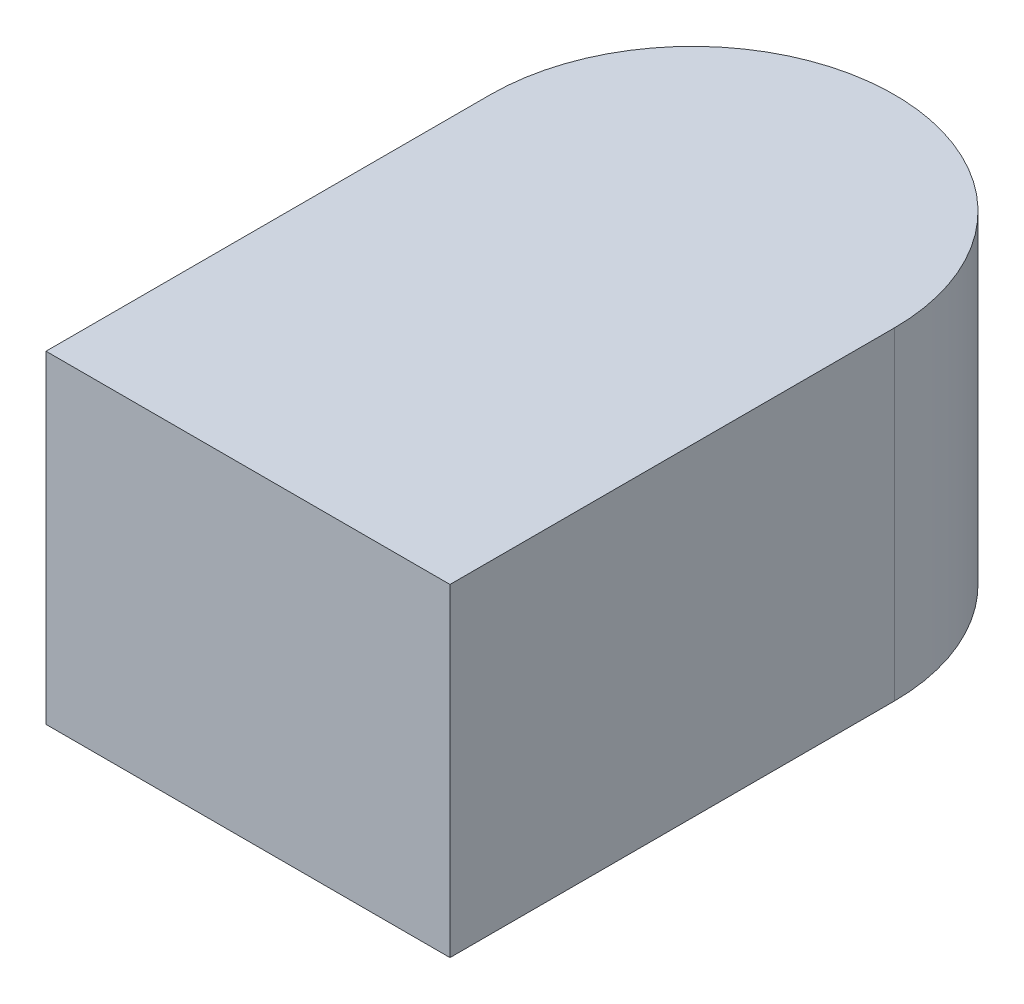
ISO-10303-21;
HEADER;
FILE_DESCRIPTION(('STEP AP214'),'2;1');
FILE_NAME('part.step','',(''),(''),'','','');
FILE_SCHEMA(('AUTOMOTIVE_DESIGN { 1 0 10303 214 1 1 1 1 }'));
ENDSEC;
DATA;
#1=APPLICATION_CONTEXT('core data for automotive mechanical design processes');
#2=APPLICATION_PROTOCOL_DEFINITION('international standard','automotive_design',2000,#1);
#3=PRODUCT_CONTEXT('',#1,'mechanical');
#4=PRODUCT('Part','Part','',(#3));
#5=PRODUCT_RELATED_PRODUCT_CATEGORY('part','',(#4));
#6=PRODUCT_DEFINITION_FORMATION('','',#4);
#7=PRODUCT_DEFINITION_CONTEXT('part definition',#1,'design');
#8=PRODUCT_DEFINITION('design','',#6,#7);
#9=PRODUCT_DEFINITION_SHAPE('','',#8);
#10=(LENGTH_UNIT() NAMED_UNIT(*) SI_UNIT(.MILLI.,.METRE.));
#11=(NAMED_UNIT(*) PLANE_ANGLE_UNIT() SI_UNIT($,.RADIAN.));
#12=(NAMED_UNIT(*) SI_UNIT($,.STERADIAN.) SOLID_ANGLE_UNIT());
#13=UNCERTAINTY_MEASURE_WITH_UNIT(LENGTH_MEASURE(1.E-05),#10,'distance_accuracy_value','');
#14=(GEOMETRIC_REPRESENTATION_CONTEXT(3) GLOBAL_UNCERTAINTY_ASSIGNED_CONTEXT((#13)) GLOBAL_UNIT_ASSIGNED_CONTEXT((#10,
#11,#12)) REPRESENTATION_CONTEXT('',''));
#15=CARTESIAN_POINT('',(0.,0.,0.));
#16=DIRECTION('',(0.,0.,1.));
#17=DIRECTION('',(1.,0.,0.));
#18=AXIS2_PLACEMENT_3D('',#15,#16,#17);
#19=CARTESIAN_POINT('',(0.,0.,0.));
#20=DIRECTION('',(0.,-1.,0.));
#21=DIRECTION('',(1.,0.,0.));
#22=AXIS2_PLACEMENT_3D('',#19,#20,#21);
#23=PLANE('',#22);
#24=CARTESIAN_POINT('',(-0.25,0.,1.225));
#25=DIRECTION('',(0.,-1.,0.));
#26=DIRECTION('',(-1.,0.,0.));
#27=AXIS2_PLACEMENT_3D('',#24,#25,#26);
#28=CIRCLE('',#27,0.125);
#29=CARTESIAN_POINT('',(-0.375,0.,1.225));
#30=VERTEX_POINT('',#29);
#31=CARTESIAN_POINT('',(-0.125,0.,1.225));
#32=VERTEX_POINT('',#31);
#33=EDGE_CURVE('E11',#30,#32,#28,.T.);
#34=ORIENTED_EDGE('',*,*,#33,.T.);
#35=DIRECTION('',(0.,0.,1.));
#36=VECTOR('',#35,1.);
#37=CARTESIAN_POINT('',(-0.125,0.,1.225));
#38=LINE('',#37,#36);
#39=CARTESIAN_POINT('',(-0.125,0.,1.5));
#40=VERTEX_POINT('',#39);
#41=EDGE_CURVE('E24',#32,#40,#38,.T.);
#42=ORIENTED_EDGE('',*,*,#41,.T.);
#43=DIRECTION('',(-1.,0.,0.));
#44=VECTOR('',#43,1.);
#45=CARTESIAN_POINT('',(-0.125,0.,1.5));
#46=LINE('',#45,#44);
#47=CARTESIAN_POINT('',(-0.375,0.,1.5));
#48=VERTEX_POINT('',#47);
#49=EDGE_CURVE('E62',#40,#48,#46,.T.);
#50=ORIENTED_EDGE('',*,*,#49,.T.);
#51=DIRECTION('',(0.,0.,-1.));
#52=VECTOR('',#51,1.);
#53=CARTESIAN_POINT('',(-0.375,0.,1.5));
#54=LINE('',#53,#52);
#55=EDGE_CURVE('E36',#48,#30,#54,.T.);
#56=ORIENTED_EDGE('',*,*,#55,.T.);
#57=EDGE_LOOP('',(#34,#42,#50,#56));
#58=FACE_BOUND('',#57,.T.);
#59=ADVANCED_FACE('F17',(#58),#23,.T.);
#60=CARTESIAN_POINT('',(-0.375,0.,1.5));
#61=DIRECTION('',(1.,0.,0.));
#62=DIRECTION('',(0.,0.,-1.));
#63=AXIS2_PLACEMENT_3D('',#60,#61,#62);
#64=PLANE('',#63);
#65=DIRECTION('',(0.,1.,0.));
#66=VECTOR('',#65,1.);
#67=CARTESIAN_POINT('',(-0.375,0.,1.5));
#68=LINE('',#67,#66);
#69=CARTESIAN_POINT('',(-0.375,0.2,1.5));
#70=VERTEX_POINT('',#69);
#71=EDGE_CURVE('E84',#48,#70,#68,.T.);
#72=ORIENTED_EDGE('',*,*,#71,.T.);
#73=DIRECTION('',(0.,0.,-1.));
#74=VECTOR('',#73,1.);
#75=CARTESIAN_POINT('',(-0.375,0.2,1.5));
#76=LINE('',#75,#74);
#77=CARTESIAN_POINT('',(-0.375,0.2,1.225));
#78=VERTEX_POINT('',#77);
#79=EDGE_CURVE('E74',#70,#78,#76,.T.);
#80=ORIENTED_EDGE('',*,*,#79,.T.);
#81=DIRECTION('',(0.,1.,0.));
#82=VECTOR('',#81,1.);
#83=CARTESIAN_POINT('',(-0.375,0.,1.225));
#84=LINE('',#83,#82);
#85=EDGE_CURVE('E81',#30,#78,#84,.T.);
#86=ORIENTED_EDGE('',*,*,#85,.F.);
#87=ORIENTED_EDGE('',*,*,#55,.F.);
#88=EDGE_LOOP('',(#72,#80,#86,#87));
#89=FACE_BOUND('',#88,.T.);
#90=ADVANCED_FACE('F91',(#89),#64,.F.);
#91=CARTESIAN_POINT('',(-0.25,0.,1.225));
#92=DIRECTION('',(0.,-1.,0.));
#93=DIRECTION('',(1.,0.,0.));
#94=AXIS2_PLACEMENT_3D('',#91,#92,#93);
#95=CYLINDRICAL_SURFACE('',#94,0.125);
#96=ORIENTED_EDGE('',*,*,#85,.T.);
#97=CARTESIAN_POINT('',(-0.25,0.2,1.225));
#98=DIRECTION('',(0.,-1.,0.));
#99=DIRECTION('',(-1.,0.,0.));
#100=AXIS2_PLACEMENT_3D('',#97,#98,#99);
#101=CIRCLE('',#100,0.125);
#102=CARTESIAN_POINT('',(-0.125,0.2,1.225));
#103=VERTEX_POINT('',#102);
#104=EDGE_CURVE('E79',#78,#103,#101,.T.);
#105=ORIENTED_EDGE('',*,*,#104,.T.);
#106=DIRECTION('',(0.,1.,0.));
#107=VECTOR('',#106,1.);
#108=CARTESIAN_POINT('',(-0.125,0.,1.225));
#109=LINE('',#108,#107);
#110=EDGE_CURVE('E68',#32,#103,#109,.T.);
#111=ORIENTED_EDGE('',*,*,#110,.F.);
#112=ORIENTED_EDGE('',*,*,#33,.F.);
#113=EDGE_LOOP('',(#96,#105,#111,#112));
#114=FACE_BOUND('',#113,.T.);
#115=ADVANCED_FACE('F89',(#114),#95,.T.);
#116=CARTESIAN_POINT('',(-0.125,0.,1.225));
#117=DIRECTION('',(-1.,0.,0.));
#118=DIRECTION('',(0.,0.,1.));
#119=AXIS2_PLACEMENT_3D('',#116,#117,#118);
#120=PLANE('',#119);
#121=ORIENTED_EDGE('',*,*,#110,.T.);
#122=DIRECTION('',(0.,0.,1.));
#123=VECTOR('',#122,1.);
#124=CARTESIAN_POINT('',(-0.125,0.2,1.225));
#125=LINE('',#124,#123);
#126=CARTESIAN_POINT('',(-0.125,0.2,1.5));
#127=VERTEX_POINT('',#126);
#128=EDGE_CURVE('E63',#103,#127,#125,.T.);
#129=ORIENTED_EDGE('',*,*,#128,.T.);
#130=DIRECTION('',(0.,1.,0.));
#131=VECTOR('',#130,1.);
#132=CARTESIAN_POINT('',(-0.125,0.,1.5));
#133=LINE('',#132,#131);
#134=EDGE_CURVE('E56',#40,#127,#133,.T.);
#135=ORIENTED_EDGE('',*,*,#134,.F.);
#136=ORIENTED_EDGE('',*,*,#41,.F.);
#137=EDGE_LOOP('',(#121,#129,#135,#136));
#138=FACE_BOUND('',#137,.T.);
#139=ADVANCED_FACE('F66',(#138),#120,.F.);
#140=CARTESIAN_POINT('',(-0.125,0.,1.5));
#141=DIRECTION('',(0.,0.,-1.));
#142=DIRECTION('',(-1.,0.,0.));
#143=AXIS2_PLACEMENT_3D('',#140,#141,#142);
#144=PLANE('',#143);
#145=ORIENTED_EDGE('',*,*,#134,.T.);
#146=DIRECTION('',(-1.,0.,0.));
#147=VECTOR('',#146,1.);
#148=CARTESIAN_POINT('',(-0.125,0.2,1.5));
#149=LINE('',#148,#147);
#150=EDGE_CURVE('E61',#127,#70,#149,.T.);
#151=ORIENTED_EDGE('',*,*,#150,.T.);
#152=ORIENTED_EDGE('',*,*,#71,.F.);
#153=ORIENTED_EDGE('',*,*,#49,.F.);
#154=EDGE_LOOP('',(#145,#151,#152,#153));
#155=FACE_BOUND('',#154,.T.);
#156=ADVANCED_FACE('F58',(#155),#144,.F.);
#157=CARTESIAN_POINT('',(0.,0.2,0.));
#158=DIRECTION('',(0.,-1.,0.));
#159=DIRECTION('',(1.,0.,0.));
#160=AXIS2_PLACEMENT_3D('',#157,#158,#159);
#161=PLANE('',#160);
#162=ORIENTED_EDGE('',*,*,#150,.F.);
#163=ORIENTED_EDGE('',*,*,#128,.F.);
#164=ORIENTED_EDGE('',*,*,#104,.F.);
#165=ORIENTED_EDGE('',*,*,#79,.F.);
#166=EDGE_LOOP('',(#162,#163,#164,#165));
#167=FACE_BOUND('',#166,.T.);
#168=ADVANCED_FACE('F72',(#167),#161,.F.);
#169=CLOSED_SHELL('',(#59,#90,#115,#139,#156,#168));
#170=MANIFOLD_SOLID_BREP('B1',#169);
#171=ADVANCED_BREP_SHAPE_REPRESENTATION('',(#18,#170),#14);
#172=SHAPE_DEFINITION_REPRESENTATION(#9,#171);
ENDSEC;
END-ISO-10303-21;
